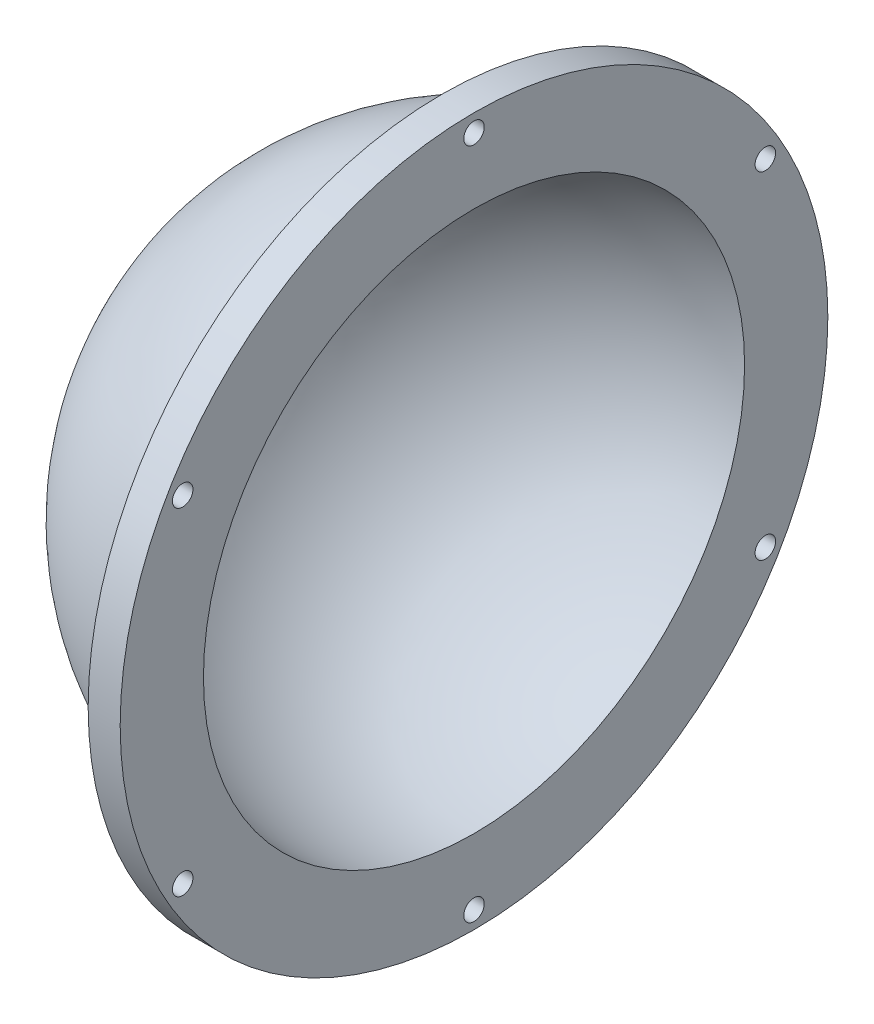
ISO-10303-21;
HEADER;
FILE_DESCRIPTION(('STEP AP214'),'2;1');
FILE_NAME('part.step','',(''),(''),'','','');
FILE_SCHEMA(('AUTOMOTIVE_DESIGN { 1 0 10303 214 1 1 1 1 }'));
ENDSEC;
DATA;
#1=APPLICATION_CONTEXT('core data for automotive mechanical design processes');
#2=APPLICATION_PROTOCOL_DEFINITION('international standard','automotive_design',2000,#1);
#3=PRODUCT_CONTEXT('',#1,'mechanical');
#4=PRODUCT('Part','Part','',(#3));
#5=PRODUCT_RELATED_PRODUCT_CATEGORY('part','',(#4));
#6=PRODUCT_DEFINITION_FORMATION('','',#4);
#7=PRODUCT_DEFINITION_CONTEXT('part definition',#1,'design');
#8=PRODUCT_DEFINITION('design','',#6,#7);
#9=PRODUCT_DEFINITION_SHAPE('','',#8);
#10=(LENGTH_UNIT() NAMED_UNIT(*) SI_UNIT(.MILLI.,.METRE.));
#11=(NAMED_UNIT(*) PLANE_ANGLE_UNIT() SI_UNIT($,.RADIAN.));
#12=(NAMED_UNIT(*) SI_UNIT($,.STERADIAN.) SOLID_ANGLE_UNIT());
#13=UNCERTAINTY_MEASURE_WITH_UNIT(LENGTH_MEASURE(1.E-05),#10,'distance_accuracy_value','');
#14=(GEOMETRIC_REPRESENTATION_CONTEXT(3) GLOBAL_UNCERTAINTY_ASSIGNED_CONTEXT((#13)) GLOBAL_UNIT_ASSIGNED_CONTEXT((#10,
#11,#12)) REPRESENTATION_CONTEXT('',''));
#15=CARTESIAN_POINT('',(0.,0.,0.));
#16=DIRECTION('',(0.,0.,1.));
#17=DIRECTION('',(1.,0.,0.));
#18=AXIS2_PLACEMENT_3D('',#15,#16,#17);
#19=CARTESIAN_POINT('',(0.,0.,0.));
#20=DIRECTION('',(1.,0.,0.));
#21=DIRECTION('',(0.,-1.,0.));
#22=AXIS2_PLACEMENT_3D('',#19,#20,#21);
#23=SPHERICAL_SURFACE('',#22,42.25);
#24=CARTESIAN_POINT('',(0.,0.,0.));
#25=DIRECTION('',(1.,0.,0.));
#26=DIRECTION('',(0.,0.,-1.));
#27=AXIS2_PLACEMENT_3D('',#24,#25,#26);
#28=CIRCLE('',#27,42.25);
#29=CARTESIAN_POINT('',(0.,0.,-42.25));
#30=VERTEX_POINT('',#29);
#31=EDGE_CURVE('E10',#30,#30,#28,.T.);
#32=ORIENTED_EDGE('',*,*,#31,.T.);
#33=EDGE_LOOP('',(#32));
#34=FACE_BOUND('',#33,.T.);
#35=ADVANCED_FACE('F30',(#34),#23,.F.);
#36=CARTESIAN_POINT('',(0.,42.25,0.));
#37=DIRECTION('',(1.,0.,0.));
#38=DIRECTION('',(0.,0.,-1.));
#39=AXIS2_PLACEMENT_3D('',#36,#37,#38);
#40=PLANE('',#39);
#41=CARTESIAN_POINT('',(0.,52.525,0.));
#42=DIRECTION('',(-1.,0.,0.));
#43=DIRECTION('',(0.,0.,1.));
#44=AXIS2_PLACEMENT_3D('',#41,#42,#43);
#45=CIRCLE('',#44,1.6);
#46=CARTESIAN_POINT('',(0.,52.525,1.6));
#47=VERTEX_POINT('',#46);
#48=EDGE_CURVE('E79',#47,#47,#45,.T.);
#49=ORIENTED_EDGE('',*,*,#48,.T.);
#50=EDGE_LOOP('',(#49));
#51=FACE_BOUND('',#50,.T.);
#52=CARTESIAN_POINT('',(0.,26.2625000000045,45.4879843337802));
#53=DIRECTION('',(-1.,0.,0.));
#54=DIRECTION('',(0.,0.,1.));
#55=AXIS2_PLACEMENT_3D('',#52,#53,#54);
#56=CIRCLE('',#55,1.6);
#57=CARTESIAN_POINT('',(0.,26.2625000000045,47.0879843337802));
#58=VERTEX_POINT('',#57);
#59=EDGE_CURVE('E73',#58,#58,#56,.T.);
#60=ORIENTED_EDGE('',*,*,#59,.T.);
#61=EDGE_LOOP('',(#60));
#62=FACE_BOUND('',#61,.T.);
#63=CARTESIAN_POINT('',(0.,-26.2624999999955,45.4879843337855));
#64=DIRECTION('',(-1.,0.,0.));
#65=DIRECTION('',(0.,0.,1.));
#66=AXIS2_PLACEMENT_3D('',#63,#64,#65);
#67=CIRCLE('',#66,1.6);
#68=CARTESIAN_POINT('',(0.,-26.2624999999955,47.0879843337855));
#69=VERTEX_POINT('',#68);
#70=EDGE_CURVE('E67',#69,#69,#67,.T.);
#71=ORIENTED_EDGE('',*,*,#70,.T.);
#72=EDGE_LOOP('',(#71));
#73=FACE_BOUND('',#72,.T.);
#74=CARTESIAN_POINT('',(0.,-52.525,1.04370871001987E-11));
#75=DIRECTION('',(-1.,0.,0.));
#76=DIRECTION('',(0.,0.,1.));
#77=AXIS2_PLACEMENT_3D('',#74,#75,#76);
#78=CIRCLE('',#77,1.6);
#79=CARTESIAN_POINT('',(0.,-52.525,1.60000000001043));
#80=VERTEX_POINT('',#79);
#81=EDGE_CURVE('E61',#80,#80,#78,.T.);
#82=ORIENTED_EDGE('',*,*,#81,.T.);
#83=EDGE_LOOP('',(#82));
#84=FACE_BOUND('',#83,.T.);
#85=CARTESIAN_POINT('',(0.,-26.2625000000045,-45.4879843337698));
#86=DIRECTION('',(-1.,0.,0.));
#87=DIRECTION('',(0.,0.,1.));
#88=AXIS2_PLACEMENT_3D('',#85,#86,#87);
#89=CIRCLE('',#88,1.6);
#90=CARTESIAN_POINT('',(0.,-26.2625000000045,-43.8879843337698));
#91=VERTEX_POINT('',#90);
#92=EDGE_CURVE('E55',#91,#91,#89,.T.);
#93=ORIENTED_EDGE('',*,*,#92,.T.);
#94=EDGE_LOOP('',(#93));
#95=FACE_BOUND('',#94,.T.);
#96=CARTESIAN_POINT('',(0.,26.2624999999954,-45.487984333775));
#97=DIRECTION('',(-1.,0.,0.));
#98=DIRECTION('',(0.,0.,1.));
#99=AXIS2_PLACEMENT_3D('',#96,#97,#98);
#100=CIRCLE('',#99,1.6);
#101=CARTESIAN_POINT('',(0.,26.2624999999954,-43.887984333775));
#102=VERTEX_POINT('',#101);
#103=EDGE_CURVE('E49',#102,#102,#100,.T.);
#104=ORIENTED_EDGE('',*,*,#103,.T.);
#105=EDGE_LOOP('',(#104));
#106=FACE_BOUND('',#105,.T.);
#107=CARTESIAN_POINT('',(0.,0.,0.));
#108=DIRECTION('',(1.,0.,0.));
#109=DIRECTION('',(0.,0.,-1.));
#110=AXIS2_PLACEMENT_3D('',#107,#108,#109);
#111=CIRCLE('',#110,55.25);
#112=CARTESIAN_POINT('',(0.,0.,-55.25));
#113=VERTEX_POINT('',#112);
#114=EDGE_CURVE('E36',#113,#113,#111,.T.);
#115=ORIENTED_EDGE('',*,*,#114,.T.);
#116=EDGE_LOOP('',(#115));
#117=FACE_BOUND('',#116,.T.);
#118=ORIENTED_EDGE('',*,*,#31,.F.);
#119=EDGE_LOOP('',(#118));
#120=FACE_BOUND('',#119,.T.);
#121=ADVANCED_FACE('F110',(#51,#62,#73,#84,#95,#106,#117,#120),#40,.T.);
#122=CARTESIAN_POINT('',(0.,0.,0.));
#123=DIRECTION('',(1.,0.,0.));
#124=DIRECTION('',(0.,0.,-1.));
#125=AXIS2_PLACEMENT_3D('',#122,#123,#124);
#126=CYLINDRICAL_SURFACE('',#125,55.25);
#127=CARTESIAN_POINT('',(-5.,0.,0.));
#128=DIRECTION('',(1.,0.,0.));
#129=DIRECTION('',(0.,0.,-1.));
#130=AXIS2_PLACEMENT_3D('',#127,#128,#129);
#131=CIRCLE('',#130,55.25);
#132=CARTESIAN_POINT('',(-5.,0.,-55.25));
#133=VERTEX_POINT('',#132);
#134=EDGE_CURVE('E40',#133,#133,#131,.T.);
#135=ORIENTED_EDGE('',*,*,#134,.T.);
#136=EDGE_LOOP('',(#135));
#137=FACE_BOUND('',#136,.T.);
#138=ORIENTED_EDGE('',*,*,#114,.F.);
#139=EDGE_LOOP('',(#138));
#140=FACE_BOUND('',#139,.T.);
#141=ADVANCED_FACE('F92',(#137,#140),#126,.T.);
#142=CARTESIAN_POINT('',(-5.,46.9847049581031,0.));
#143=DIRECTION('',(-1.,0.,0.));
#144=DIRECTION('',(0.,0.,1.));
#145=AXIS2_PLACEMENT_3D('',#142,#143,#144);
#146=PLANE('',#145);
#147=CARTESIAN_POINT('',(-5.,52.525,0.));
#148=DIRECTION('',(-1.,0.,0.));
#149=DIRECTION('',(0.,0.,1.));
#150=AXIS2_PLACEMENT_3D('',#147,#148,#149);
#151=CIRCLE('',#150,1.6);
#152=CARTESIAN_POINT('',(-5.,52.525,1.6));
#153=VERTEX_POINT('',#152);
#154=EDGE_CURVE('E82',#153,#153,#151,.T.);
#155=ORIENTED_EDGE('',*,*,#154,.F.);
#156=EDGE_LOOP('',(#155));
#157=FACE_BOUND('',#156,.T.);
#158=CARTESIAN_POINT('',(-5.,26.2625000000045,45.4879843337802));
#159=DIRECTION('',(-1.,0.,0.));
#160=DIRECTION('',(0.,0.,1.));
#161=AXIS2_PLACEMENT_3D('',#158,#159,#160);
#162=CIRCLE('',#161,1.6);
#163=CARTESIAN_POINT('',(-5.,26.2625000000045,47.0879843337802));
#164=VERTEX_POINT('',#163);
#165=EDGE_CURVE('E76',#164,#164,#162,.T.);
#166=ORIENTED_EDGE('',*,*,#165,.F.);
#167=EDGE_LOOP('',(#166));
#168=FACE_BOUND('',#167,.T.);
#169=CARTESIAN_POINT('',(-5.,-26.2624999999955,45.4879843337855));
#170=DIRECTION('',(-1.,0.,0.));
#171=DIRECTION('',(0.,0.,1.));
#172=AXIS2_PLACEMENT_3D('',#169,#170,#171);
#173=CIRCLE('',#172,1.6);
#174=CARTESIAN_POINT('',(-5.,-26.2624999999955,47.0879843337855));
#175=VERTEX_POINT('',#174);
#176=EDGE_CURVE('E70',#175,#175,#173,.T.);
#177=ORIENTED_EDGE('',*,*,#176,.F.);
#178=EDGE_LOOP('',(#177));
#179=FACE_BOUND('',#178,.T.);
#180=CARTESIAN_POINT('',(-5.,-52.525,1.04370871001987E-11));
#181=DIRECTION('',(-1.,0.,0.));
#182=DIRECTION('',(0.,0.,1.));
#183=AXIS2_PLACEMENT_3D('',#180,#181,#182);
#184=CIRCLE('',#183,1.6);
#185=CARTESIAN_POINT('',(-5.,-52.525,1.60000000001043));
#186=VERTEX_POINT('',#185);
#187=EDGE_CURVE('E64',#186,#186,#184,.T.);
#188=ORIENTED_EDGE('',*,*,#187,.F.);
#189=EDGE_LOOP('',(#188));
#190=FACE_BOUND('',#189,.T.);
#191=CARTESIAN_POINT('',(-5.,-26.2625000000045,-45.4879843337698));
#192=DIRECTION('',(-1.,0.,0.));
#193=DIRECTION('',(0.,0.,1.));
#194=AXIS2_PLACEMENT_3D('',#191,#192,#193);
#195=CIRCLE('',#194,1.6);
#196=CARTESIAN_POINT('',(-5.,-26.2625000000045,-43.8879843337698));
#197=VERTEX_POINT('',#196);
#198=EDGE_CURVE('E58',#197,#197,#195,.T.);
#199=ORIENTED_EDGE('',*,*,#198,.F.);
#200=EDGE_LOOP('',(#199));
#201=FACE_BOUND('',#200,.T.);
#202=CARTESIAN_POINT('',(-5.,26.2624999999954,-45.487984333775));
#203=DIRECTION('',(-1.,0.,0.));
#204=DIRECTION('',(0.,0.,1.));
#205=AXIS2_PLACEMENT_3D('',#202,#203,#204);
#206=CIRCLE('',#205,1.6);
#207=CARTESIAN_POINT('',(-5.,26.2624999999954,-43.887984333775));
#208=VERTEX_POINT('',#207);
#209=EDGE_CURVE('E52',#208,#208,#206,.T.);
#210=ORIENTED_EDGE('',*,*,#209,.F.);
#211=EDGE_LOOP('',(#210));
#212=FACE_BOUND('',#211,.T.);
#213=CARTESIAN_POINT('',(-5.,0.,0.));
#214=DIRECTION('',(1.,0.,0.));
#215=DIRECTION('',(0.,0.,-1.));
#216=AXIS2_PLACEMENT_3D('',#213,#214,#215);
#217=CIRCLE('',#216,46.9847049581031);
#218=CARTESIAN_POINT('',(-5.,0.,-46.9847049581031));
#219=VERTEX_POINT('',#218);
#220=EDGE_CURVE('E44',#219,#219,#217,.T.);
#221=ORIENTED_EDGE('',*,*,#220,.T.);
#222=EDGE_LOOP('',(#221));
#223=FACE_BOUND('',#222,.T.);
#224=ORIENTED_EDGE('',*,*,#134,.F.);
#225=EDGE_LOOP('',(#224));
#226=FACE_BOUND('',#225,.T.);
#227=ADVANCED_FACE('F88',(#157,#168,#179,#190,#201,#212,#223,#226),#146,.T.);
#228=CARTESIAN_POINT('',(0.,0.,0.));
#229=DIRECTION('',(1.,0.,0.));
#230=DIRECTION('',(0.,1.,0.));
#231=AXIS2_PLACEMENT_3D('',#228,#229,#230);
#232=SPHERICAL_SURFACE('',#231,47.25);
#233=ORIENTED_EDGE('',*,*,#220,.F.);
#234=EDGE_LOOP('',(#233));
#235=FACE_BOUND('',#234,.T.);
#236=ADVANCED_FACE('F91',(#235),#232,.T.);
#237=CARTESIAN_POINT('',(-5.,26.2624999999954,-45.487984333775));
#238=DIRECTION('',(-1.,0.,0.));
#239=DIRECTION('',(0.,0.,1.));
#240=AXIS2_PLACEMENT_3D('',#237,#238,#239);
#241=CYLINDRICAL_SURFACE('',#240,1.6);
#242=ORIENTED_EDGE('',*,*,#103,.F.);
#243=EDGE_LOOP('',(#242));
#244=FACE_BOUND('',#243,.T.);
#245=ORIENTED_EDGE('',*,*,#209,.T.);
#246=EDGE_LOOP('',(#245));
#247=FACE_BOUND('',#246,.T.);
#248=ADVANCED_FACE('F139',(#244,#247),#241,.F.);
#249=CARTESIAN_POINT('',(-5.,-26.2625000000045,-45.4879843337698));
#250=DIRECTION('',(-1.,0.,0.));
#251=DIRECTION('',(0.,0.,1.));
#252=AXIS2_PLACEMENT_3D('',#249,#250,#251);
#253=CYLINDRICAL_SURFACE('',#252,1.6);
#254=ORIENTED_EDGE('',*,*,#92,.F.);
#255=EDGE_LOOP('',(#254));
#256=FACE_BOUND('',#255,.T.);
#257=ORIENTED_EDGE('',*,*,#198,.T.);
#258=EDGE_LOOP('',(#257));
#259=FACE_BOUND('',#258,.T.);
#260=ADVANCED_FACE('F144',(#256,#259),#253,.F.);
#261=CARTESIAN_POINT('',(-5.,-52.525,1.04370871001987E-11));
#262=DIRECTION('',(-1.,0.,0.));
#263=DIRECTION('',(0.,0.,1.));
#264=AXIS2_PLACEMENT_3D('',#261,#262,#263);
#265=CYLINDRICAL_SURFACE('',#264,1.6);
#266=ORIENTED_EDGE('',*,*,#81,.F.);
#267=EDGE_LOOP('',(#266));
#268=FACE_BOUND('',#267,.T.);
#269=ORIENTED_EDGE('',*,*,#187,.T.);
#270=EDGE_LOOP('',(#269));
#271=FACE_BOUND('',#270,.T.);
#272=ADVANCED_FACE('F154',(#268,#271),#265,.F.);
#273=CARTESIAN_POINT('',(-5.,-26.2624999999955,45.4879843337855));
#274=DIRECTION('',(-1.,0.,0.));
#275=DIRECTION('',(0.,0.,1.));
#276=AXIS2_PLACEMENT_3D('',#273,#274,#275);
#277=CYLINDRICAL_SURFACE('',#276,1.6);
#278=ORIENTED_EDGE('',*,*,#70,.F.);
#279=EDGE_LOOP('',(#278));
#280=FACE_BOUND('',#279,.T.);
#281=ORIENTED_EDGE('',*,*,#176,.T.);
#282=EDGE_LOOP('',(#281));
#283=FACE_BOUND('',#282,.T.);
#284=ADVANCED_FACE('F164',(#280,#283),#277,.F.);
#285=CARTESIAN_POINT('',(-5.,26.2625000000045,45.4879843337802));
#286=DIRECTION('',(-1.,0.,0.));
#287=DIRECTION('',(0.,0.,1.));
#288=AXIS2_PLACEMENT_3D('',#285,#286,#287);
#289=CYLINDRICAL_SURFACE('',#288,1.6);
#290=ORIENTED_EDGE('',*,*,#59,.F.);
#291=EDGE_LOOP('',(#290));
#292=FACE_BOUND('',#291,.T.);
#293=ORIENTED_EDGE('',*,*,#165,.T.);
#294=EDGE_LOOP('',(#293));
#295=FACE_BOUND('',#294,.T.);
#296=ADVANCED_FACE('F174',(#292,#295),#289,.F.);
#297=CARTESIAN_POINT('',(-5.,52.525,0.));
#298=DIRECTION('',(-1.,0.,0.));
#299=DIRECTION('',(0.,0.,1.));
#300=AXIS2_PLACEMENT_3D('',#297,#298,#299);
#301=CYLINDRICAL_SURFACE('',#300,1.6);
#302=ORIENTED_EDGE('',*,*,#48,.F.);
#303=EDGE_LOOP('',(#302));
#304=FACE_BOUND('',#303,.T.);
#305=ORIENTED_EDGE('',*,*,#154,.T.);
#306=EDGE_LOOP('',(#305));
#307=FACE_BOUND('',#306,.T.);
#308=ADVANCED_FACE('F86',(#304,#307),#301,.F.);
#309=CLOSED_SHELL('',(#35,#121,#141,#227,#236,#248,#260,#272,#284,#296,#308));
#310=MANIFOLD_SOLID_BREP('B2',#309);
#311=ADVANCED_BREP_SHAPE_REPRESENTATION('',(#18,#310),#14);
#312=SHAPE_DEFINITION_REPRESENTATION(#9,#311);
ENDSEC;
END-ISO-10303-21;
